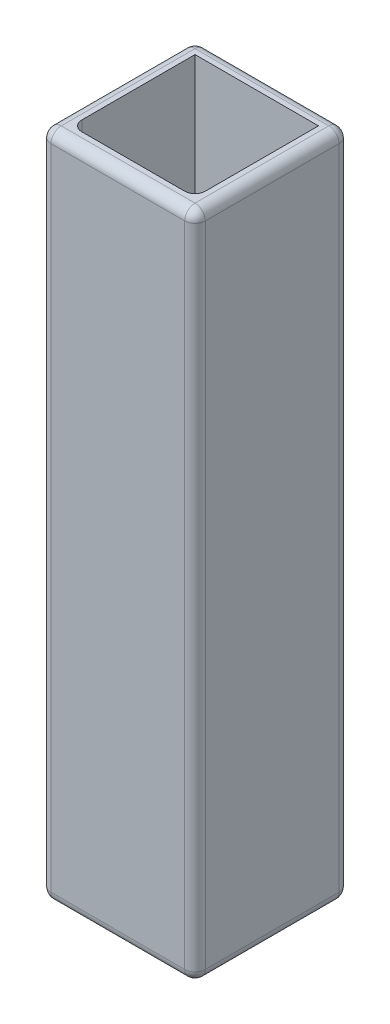
ISO-10303-21;
HEADER;
FILE_DESCRIPTION(('STEP AP214'),'2;1');
FILE_NAME('part.step','',(''),(''),'','','');
FILE_SCHEMA(('AUTOMOTIVE_DESIGN { 1 0 10303 214 1 1 1 1 }'));
ENDSEC;
DATA;
#1=APPLICATION_CONTEXT('core data for automotive mechanical design processes');
#2=APPLICATION_PROTOCOL_DEFINITION('international standard','automotive_design',2000,#1);
#3=PRODUCT_CONTEXT('',#1,'mechanical');
#4=PRODUCT('Part','Part','',(#3));
#5=PRODUCT_RELATED_PRODUCT_CATEGORY('part','',(#4));
#6=PRODUCT_DEFINITION_FORMATION('','',#4);
#7=PRODUCT_DEFINITION_CONTEXT('part definition',#1,'design');
#8=PRODUCT_DEFINITION('design','',#6,#7);
#9=PRODUCT_DEFINITION_SHAPE('','',#8);
#10=(LENGTH_UNIT() NAMED_UNIT(*) SI_UNIT(.MILLI.,.METRE.));
#11=(NAMED_UNIT(*) PLANE_ANGLE_UNIT() SI_UNIT($,.RADIAN.));
#12=(NAMED_UNIT(*) SI_UNIT($,.STERADIAN.) SOLID_ANGLE_UNIT());
#13=UNCERTAINTY_MEASURE_WITH_UNIT(LENGTH_MEASURE(1.E-05),#10,'distance_accuracy_value','');
#14=(GEOMETRIC_REPRESENTATION_CONTEXT(3) GLOBAL_UNCERTAINTY_ASSIGNED_CONTEXT((#13)) GLOBAL_UNIT_ASSIGNED_CONTEXT((#10,
#11,#12)) REPRESENTATION_CONTEXT('',''));
#15=CARTESIAN_POINT('',(0.,0.,0.));
#16=DIRECTION('',(0.,0.,1.));
#17=DIRECTION('',(1.,0.,0.));
#18=AXIS2_PLACEMENT_3D('',#15,#16,#17);
#19=CARTESIAN_POINT('',(0.,130.,0.));
#20=DIRECTION('',(0.,1.,0.));
#21=DIRECTION('',(0.,0.,1.));
#22=AXIS2_PLACEMENT_3D('',#19,#20,#21);
#23=PLANE('',#22);
#24=DIRECTION('',(-1.,0.,0.));
#25=VECTOR('',#24,1.);
#26=CARTESIAN_POINT('',(-15.,130.,-13.));
#27=LINE('',#26,#25);
#28=CARTESIAN_POINT('',(13.,130.,-13.));
#29=VERTEX_POINT('',#28);
#30=CARTESIAN_POINT('',(-13.,130.,-13.));
#31=VERTEX_POINT('',#30);
#32=EDGE_CURVE('E180',#29,#31,#27,.T.);
#33=ORIENTED_EDGE('',*,*,#32,.T.);
#34=DIRECTION('',(0.,0.,1.));
#35=VECTOR('',#34,1.);
#36=CARTESIAN_POINT('',(-13.,130.,15.));
#37=LINE('',#36,#35);
#38=CARTESIAN_POINT('',(-13.,130.,13.));
#39=VERTEX_POINT('',#38);
#40=EDGE_CURVE('E206',#31,#39,#37,.T.);
#41=ORIENTED_EDGE('',*,*,#40,.T.);
#42=DIRECTION('',(1.,0.,0.));
#43=VECTOR('',#42,1.);
#44=CARTESIAN_POINT('',(15.,130.,13.));
#45=LINE('',#44,#43);
#46=CARTESIAN_POINT('',(13.,130.,13.));
#47=VERTEX_POINT('',#46);
#48=EDGE_CURVE('E204',#39,#47,#45,.T.);
#49=ORIENTED_EDGE('',*,*,#48,.T.);
#50=DIRECTION('',(0.,0.,-1.));
#51=VECTOR('',#50,1.);
#52=CARTESIAN_POINT('',(13.,130.,-15.));
#53=LINE('',#52,#51);
#54=EDGE_CURVE('E202',#47,#29,#53,.T.);
#55=ORIENTED_EDGE('',*,*,#54,.T.);
#56=EDGE_LOOP('',(#33,#41,#49,#55));
#57=FACE_BOUND('',#56,.T.);
#58=DIRECTION('',(-1.,0.,0.));
#59=VECTOR('',#58,1.);
#60=CARTESIAN_POINT('',(-12.,130.,-12.));
#61=LINE('',#60,#59);
#62=CARTESIAN_POINT('',(12.,130.,-12.));
#63=VERTEX_POINT('',#62);
#64=CARTESIAN_POINT('',(-12.,130.,-12.));
#65=VERTEX_POINT('',#64);
#66=EDGE_CURVE('E171',#63,#65,#61,.T.);
#67=ORIENTED_EDGE('',*,*,#66,.F.);
#68=DIRECTION('',(0.,0.,-1.));
#69=VECTOR('',#68,1.);
#70=CARTESIAN_POINT('',(12.,130.,-12.));
#71=LINE('',#70,#69);
#72=CARTESIAN_POINT('',(12.,130.,9.99999999999999));
#73=VERTEX_POINT('',#72);
#74=EDGE_CURVE('E161',#73,#63,#71,.T.);
#75=ORIENTED_EDGE('',*,*,#74,.F.);
#76=CARTESIAN_POINT('',(10.,130.,9.99999999999999));
#77=DIRECTION('',(0.,1.,0.));
#78=DIRECTION('',(0.,0.,1.));
#79=AXIS2_PLACEMENT_3D('',#76,#77,#78);
#80=CIRCLE('',#79,2.);
#81=CARTESIAN_POINT('',(10.,130.,12.));
#82=VERTEX_POINT('',#81);
#83=EDGE_CURVE('E11',#73,#82,#80,.F.);
#84=ORIENTED_EDGE('',*,*,#83,.T.);
#85=DIRECTION('',(1.,0.,0.));
#86=VECTOR('',#85,1.);
#87=CARTESIAN_POINT('',(-12.,130.,12.));
#88=LINE('',#87,#86);
#89=CARTESIAN_POINT('',(-9.99999999999999,130.,12.));
#90=VERTEX_POINT('',#89);
#91=EDGE_CURVE('E187',#90,#82,#88,.T.);
#92=ORIENTED_EDGE('',*,*,#91,.F.);
#93=CARTESIAN_POINT('',(-9.99999999999999,130.,9.99999999999999));
#94=DIRECTION('',(0.,1.,0.));
#95=DIRECTION('',(0.,0.,1.));
#96=AXIS2_PLACEMENT_3D('',#93,#94,#95);
#97=CIRCLE('',#96,2.);
#98=CARTESIAN_POINT('',(-12.,130.,9.99999999999999));
#99=VERTEX_POINT('',#98);
#100=EDGE_CURVE('E263',#90,#99,#97,.F.);
#101=ORIENTED_EDGE('',*,*,#100,.T.);
#102=DIRECTION('',(0.,0.,1.));
#103=VECTOR('',#102,1.);
#104=CARTESIAN_POINT('',(-12.,130.,-12.));
#105=LINE('',#104,#103);
#106=EDGE_CURVE('E185',#65,#99,#105,.T.);
#107=ORIENTED_EDGE('',*,*,#106,.F.);
#108=EDGE_LOOP('',(#67,#75,#84,#92,#101,#107));
#109=FACE_BOUND('',#108,.T.);
#110=ADVANCED_FACE('F32',(#57,#109),#23,.T.);
#111=CARTESIAN_POINT('',(0.,0.,0.));
#112=DIRECTION('',(0.,1.,0.));
#113=DIRECTION('',(0.,0.,1.));
#114=AXIS2_PLACEMENT_3D('',#111,#112,#113);
#115=PLANE('',#114);
#116=DIRECTION('',(0.,0.,-1.));
#117=VECTOR('',#116,1.);
#118=CARTESIAN_POINT('',(13.,0.,0.));
#119=LINE('',#118,#117);
#120=CARTESIAN_POINT('',(13.,0.,-13.));
#121=VERTEX_POINT('',#120);
#122=CARTESIAN_POINT('',(13.,0.,13.));
#123=VERTEX_POINT('',#122);
#124=EDGE_CURVE('E49',#121,#123,#119,.F.);
#125=ORIENTED_EDGE('',*,*,#124,.T.);
#126=DIRECTION('',(1.,0.,0.));
#127=VECTOR('',#126,1.);
#128=CARTESIAN_POINT('',(0.,0.,13.));
#129=LINE('',#128,#127);
#130=CARTESIAN_POINT('',(-13.,0.,13.));
#131=VERTEX_POINT('',#130);
#132=EDGE_CURVE('E250',#123,#131,#129,.F.);
#133=ORIENTED_EDGE('',*,*,#132,.T.);
#134=DIRECTION('',(0.,0.,1.));
#135=VECTOR('',#134,1.);
#136=CARTESIAN_POINT('',(-13.,0.,0.));
#137=LINE('',#136,#135);
#138=CARTESIAN_POINT('',(-13.,0.,-13.));
#139=VERTEX_POINT('',#138);
#140=EDGE_CURVE('E247',#131,#139,#137,.F.);
#141=ORIENTED_EDGE('',*,*,#140,.T.);
#142=DIRECTION('',(-1.,0.,0.));
#143=VECTOR('',#142,1.);
#144=CARTESIAN_POINT('',(0.,0.,-13.));
#145=LINE('',#144,#143);
#146=EDGE_CURVE('E245',#139,#121,#145,.F.);
#147=ORIENTED_EDGE('',*,*,#146,.T.);
#148=EDGE_LOOP('',(#125,#133,#141,#147));
#149=FACE_BOUND('',#148,.T.);
#150=DIRECTION('',(1.,0.,0.));
#151=VECTOR('',#150,1.);
#152=CARTESIAN_POINT('',(-12.,0.,12.));
#153=LINE('',#152,#151);
#154=CARTESIAN_POINT('',(-9.99999999999999,0.,12.));
#155=VERTEX_POINT('',#154);
#156=CARTESIAN_POINT('',(10.,0.,12.));
#157=VERTEX_POINT('',#156);
#158=EDGE_CURVE('E172',#155,#157,#153,.T.);
#159=ORIENTED_EDGE('',*,*,#158,.T.);
#160=CARTESIAN_POINT('',(10.,0.,9.99999999999999));
#161=DIRECTION('',(0.,1.,0.));
#162=DIRECTION('',(0.,0.,1.));
#163=AXIS2_PLACEMENT_3D('',#160,#161,#162);
#164=CIRCLE('',#163,2.);
#165=CARTESIAN_POINT('',(12.,0.,9.99999999999999));
#166=VERTEX_POINT('',#165);
#167=EDGE_CURVE('E41',#157,#166,#164,.T.);
#168=ORIENTED_EDGE('',*,*,#167,.T.);
#169=DIRECTION('',(0.,0.,-1.));
#170=VECTOR('',#169,1.);
#171=CARTESIAN_POINT('',(12.,0.,-12.));
#172=LINE('',#171,#170);
#173=CARTESIAN_POINT('',(12.,0.,-12.));
#174=VERTEX_POINT('',#173);
#175=EDGE_CURVE('E192',#166,#174,#172,.T.);
#176=ORIENTED_EDGE('',*,*,#175,.T.);
#177=DIRECTION('',(-1.,0.,0.));
#178=VECTOR('',#177,1.);
#179=CARTESIAN_POINT('',(-12.,0.,-12.));
#180=LINE('',#179,#178);
#181=CARTESIAN_POINT('',(-12.,0.,-12.));
#182=VERTEX_POINT('',#181);
#183=EDGE_CURVE('E179',#174,#182,#180,.T.);
#184=ORIENTED_EDGE('',*,*,#183,.T.);
#185=DIRECTION('',(0.,0.,1.));
#186=VECTOR('',#185,1.);
#187=CARTESIAN_POINT('',(-12.,0.,-12.));
#188=LINE('',#187,#186);
#189=CARTESIAN_POINT('',(-12.,0.,9.99999999999999));
#190=VERTEX_POINT('',#189);
#191=EDGE_CURVE('E195',#182,#190,#188,.T.);
#192=ORIENTED_EDGE('',*,*,#191,.T.);
#193=CARTESIAN_POINT('',(-9.99999999999999,0.,9.99999999999999));
#194=DIRECTION('',(0.,1.,0.));
#195=DIRECTION('',(0.,0.,1.));
#196=AXIS2_PLACEMENT_3D('',#193,#194,#195);
#197=CIRCLE('',#196,2.);
#198=EDGE_CURVE('E261',#190,#155,#197,.T.);
#199=ORIENTED_EDGE('',*,*,#198,.T.);
#200=EDGE_LOOP('',(#159,#168,#176,#184,#192,#199));
#201=FACE_BOUND('',#200,.T.);
#202=ADVANCED_FACE('F375',(#149,#201),#115,.F.);
#203=CARTESIAN_POINT('',(15.,130.,-15.));
#204=DIRECTION('',(-1.,0.,0.));
#205=DIRECTION('',(0.,0.,1.));
#206=AXIS2_PLACEMENT_3D('',#203,#204,#205);
#207=PLANE('',#206);
#208=DIRECTION('',(0.,0.,-1.));
#209=VECTOR('',#208,1.);
#210=CARTESIAN_POINT('',(15.,2.,-15.));
#211=LINE('',#210,#209);
#212=CARTESIAN_POINT('',(15.,2.,13.));
#213=VERTEX_POINT('',#212);
#214=CARTESIAN_POINT('',(15.,2.,-13.));
#215=VERTEX_POINT('',#214);
#216=EDGE_CURVE('E229',#213,#215,#211,.T.);
#217=ORIENTED_EDGE('',*,*,#216,.T.);
#218=DIRECTION('',(0.,-1.,0.));
#219=VECTOR('',#218,1.);
#220=CARTESIAN_POINT('',(15.,130.,-13.));
#221=LINE('',#220,#219);
#222=CARTESIAN_POINT('',(15.,128.,-13.));
#223=VERTEX_POINT('',#222);
#224=EDGE_CURVE('E234',#215,#223,#221,.F.);
#225=ORIENTED_EDGE('',*,*,#224,.T.);
#226=DIRECTION('',(0.,0.,-1.));
#227=VECTOR('',#226,1.);
#228=CARTESIAN_POINT('',(15.,128.,15.));
#229=LINE('',#228,#227);
#230=CARTESIAN_POINT('',(15.,128.,13.));
#231=VERTEX_POINT('',#230);
#232=EDGE_CURVE('E231',#223,#231,#229,.F.);
#233=ORIENTED_EDGE('',*,*,#232,.T.);
#234=DIRECTION('',(0.,-1.,0.));
#235=VECTOR('',#234,1.);
#236=CARTESIAN_POINT('',(15.,130.,13.));
#237=LINE('',#236,#235);
#238=EDGE_CURVE('E227',#231,#213,#237,.T.);
#239=ORIENTED_EDGE('',*,*,#238,.T.);
#240=EDGE_LOOP('',(#217,#225,#233,#239));
#241=FACE_BOUND('',#240,.T.);
#242=ADVANCED_FACE('F354',(#241),#207,.F.);
#243=CARTESIAN_POINT('',(-15.,130.,-15.));
#244=DIRECTION('',(0.,0.,1.));
#245=DIRECTION('',(1.,0.,0.));
#246=AXIS2_PLACEMENT_3D('',#243,#244,#245);
#247=PLANE('',#246);
#248=DIRECTION('',(-1.,0.,0.));
#249=VECTOR('',#248,1.);
#250=CARTESIAN_POINT('',(-15.,2.,-15.));
#251=LINE('',#250,#249);
#252=CARTESIAN_POINT('',(13.,2.,-15.));
#253=VERTEX_POINT('',#252);
#254=CARTESIAN_POINT('',(-13.,2.,-15.));
#255=VERTEX_POINT('',#254);
#256=EDGE_CURVE('E238',#253,#255,#251,.T.);
#257=ORIENTED_EDGE('',*,*,#256,.T.);
#258=DIRECTION('',(0.,-1.,0.));
#259=VECTOR('',#258,1.);
#260=CARTESIAN_POINT('',(-13.,130.,-15.));
#261=LINE('',#260,#259);
#262=CARTESIAN_POINT('',(-13.,128.,-15.));
#263=VERTEX_POINT('',#262);
#264=EDGE_CURVE('E243',#255,#263,#261,.F.);
#265=ORIENTED_EDGE('',*,*,#264,.T.);
#266=DIRECTION('',(-1.,0.,0.));
#267=VECTOR('',#266,1.);
#268=CARTESIAN_POINT('',(15.,128.,-15.));
#269=LINE('',#268,#267);
#270=CARTESIAN_POINT('',(13.,128.,-15.));
#271=VERTEX_POINT('',#270);
#272=EDGE_CURVE('E240',#263,#271,#269,.F.);
#273=ORIENTED_EDGE('',*,*,#272,.T.);
#274=DIRECTION('',(0.,-1.,0.));
#275=VECTOR('',#274,1.);
#276=CARTESIAN_POINT('',(13.,130.,-15.));
#277=LINE('',#276,#275);
#278=EDGE_CURVE('E236',#271,#253,#277,.T.);
#279=ORIENTED_EDGE('',*,*,#278,.T.);
#280=EDGE_LOOP('',(#257,#265,#273,#279));
#281=FACE_BOUND('',#280,.T.);
#282=ADVANCED_FACE('F345',(#281),#247,.F.);
#283=CARTESIAN_POINT('',(-15.,130.,-15.));
#284=DIRECTION('',(1.,0.,0.));
#285=DIRECTION('',(0.,0.,-1.));
#286=AXIS2_PLACEMENT_3D('',#283,#284,#285);
#287=PLANE('',#286);
#288=DIRECTION('',(0.,0.,1.));
#289=VECTOR('',#288,1.);
#290=CARTESIAN_POINT('',(-15.,128.,-15.));
#291=LINE('',#290,#289);
#292=CARTESIAN_POINT('',(-15.,128.,13.));
#293=VERTEX_POINT('',#292);
#294=CARTESIAN_POINT('',(-15.,128.,-13.));
#295=VERTEX_POINT('',#294);
#296=EDGE_CURVE('E213',#293,#295,#291,.F.);
#297=ORIENTED_EDGE('',*,*,#296,.T.);
#298=DIRECTION('',(0.,-1.,0.));
#299=VECTOR('',#298,1.);
#300=CARTESIAN_POINT('',(-15.,130.,-13.));
#301=LINE('',#300,#299);
#302=CARTESIAN_POINT('',(-15.,2.,-13.));
#303=VERTEX_POINT('',#302);
#304=EDGE_CURVE('E216',#295,#303,#301,.T.);
#305=ORIENTED_EDGE('',*,*,#304,.T.);
#306=DIRECTION('',(0.,0.,1.));
#307=VECTOR('',#306,1.);
#308=CARTESIAN_POINT('',(-15.,2.,-15.));
#309=LINE('',#308,#307);
#310=CARTESIAN_POINT('',(-15.,2.,13.));
#311=VERTEX_POINT('',#310);
#312=EDGE_CURVE('E211',#303,#311,#309,.T.);
#313=ORIENTED_EDGE('',*,*,#312,.T.);
#314=DIRECTION('',(0.,-1.,0.));
#315=VECTOR('',#314,1.);
#316=CARTESIAN_POINT('',(-15.,130.,13.));
#317=LINE('',#316,#315);
#318=EDGE_CURVE('E209',#311,#293,#317,.F.);
#319=ORIENTED_EDGE('',*,*,#318,.T.);
#320=EDGE_LOOP('',(#297,#305,#313,#319));
#321=FACE_BOUND('',#320,.T.);
#322=ADVANCED_FACE('F420',(#321),#287,.F.);
#323=CARTESIAN_POINT('',(-15.,130.,15.));
#324=DIRECTION('',(0.,0.,-1.));
#325=DIRECTION('',(-1.,0.,0.));
#326=AXIS2_PLACEMENT_3D('',#323,#324,#325);
#327=PLANE('',#326);
#328=DIRECTION('',(1.,0.,0.));
#329=VECTOR('',#328,1.);
#330=CARTESIAN_POINT('',(-15.,128.,15.));
#331=LINE('',#330,#329);
#332=CARTESIAN_POINT('',(13.,128.,15.));
#333=VERTEX_POINT('',#332);
#334=CARTESIAN_POINT('',(-13.,128.,15.));
#335=VERTEX_POINT('',#334);
#336=EDGE_CURVE('E222',#333,#335,#331,.F.);
#337=ORIENTED_EDGE('',*,*,#336,.T.);
#338=DIRECTION('',(0.,-1.,0.));
#339=VECTOR('',#338,1.);
#340=CARTESIAN_POINT('',(-13.,130.,15.));
#341=LINE('',#340,#339);
#342=CARTESIAN_POINT('',(-13.,2.,15.));
#343=VERTEX_POINT('',#342);
#344=EDGE_CURVE('E225',#335,#343,#341,.T.);
#345=ORIENTED_EDGE('',*,*,#344,.T.);
#346=DIRECTION('',(1.,0.,0.));
#347=VECTOR('',#346,1.);
#348=CARTESIAN_POINT('',(-15.,2.,15.));
#349=LINE('',#348,#347);
#350=CARTESIAN_POINT('',(13.,2.,15.));
#351=VERTEX_POINT('',#350);
#352=EDGE_CURVE('E220',#343,#351,#349,.T.);
#353=ORIENTED_EDGE('',*,*,#352,.T.);
#354=DIRECTION('',(0.,-1.,0.));
#355=VECTOR('',#354,1.);
#356=CARTESIAN_POINT('',(13.,130.,15.));
#357=LINE('',#356,#355);
#358=EDGE_CURVE('E218',#351,#333,#357,.F.);
#359=ORIENTED_EDGE('',*,*,#358,.T.);
#360=EDGE_LOOP('',(#337,#345,#353,#359));
#361=FACE_BOUND('',#360,.T.);
#362=ADVANCED_FACE('F417',(#361),#327,.F.);
#363=CARTESIAN_POINT('',(12.,130.,-12.));
#364=DIRECTION('',(-1.,0.,0.));
#365=DIRECTION('',(0.,0.,1.));
#366=AXIS2_PLACEMENT_3D('',#363,#364,#365);
#367=PLANE('',#366);
#368=ORIENTED_EDGE('',*,*,#175,.F.);
#369=DIRECTION('',(0.,-1.,0.));
#370=VECTOR('',#369,1.);
#371=CARTESIAN_POINT('',(12.,130.,9.99999999999999));
#372=LINE('',#371,#370);
#373=EDGE_CURVE('E167',#166,#73,#372,.F.);
#374=ORIENTED_EDGE('',*,*,#373,.T.);
#375=ORIENTED_EDGE('',*,*,#74,.T.);
#376=DIRECTION('',(0.,-1.,0.));
#377=VECTOR('',#376,1.);
#378=CARTESIAN_POINT('',(12.,130.,-12.));
#379=LINE('',#378,#377);
#380=EDGE_CURVE('E165',#63,#174,#379,.T.);
#381=ORIENTED_EDGE('',*,*,#380,.T.);
#382=EDGE_LOOP('',(#368,#374,#375,#381));
#383=FACE_BOUND('',#382,.T.);
#384=ADVANCED_FACE('F164',(#383),#367,.T.);
#385=CARTESIAN_POINT('',(-12.,130.,-12.));
#386=DIRECTION('',(0.,0.,1.));
#387=DIRECTION('',(1.,0.,0.));
#388=AXIS2_PLACEMENT_3D('',#385,#386,#387);
#389=PLANE('',#388);
#390=ORIENTED_EDGE('',*,*,#183,.F.);
#391=ORIENTED_EDGE('',*,*,#380,.F.);
#392=ORIENTED_EDGE('',*,*,#66,.T.);
#393=DIRECTION('',(0.,-1.,0.));
#394=VECTOR('',#393,1.);
#395=CARTESIAN_POINT('',(-12.,130.,-12.));
#396=LINE('',#395,#394);
#397=EDGE_CURVE('E181',#65,#182,#396,.T.);
#398=ORIENTED_EDGE('',*,*,#397,.T.);
#399=EDGE_LOOP('',(#390,#391,#392,#398));
#400=FACE_BOUND('',#399,.T.);
#401=ADVANCED_FACE('F176',(#400),#389,.T.);
#402=CARTESIAN_POINT('',(-12.,130.,-12.));
#403=DIRECTION('',(1.,0.,0.));
#404=DIRECTION('',(0.,0.,-1.));
#405=AXIS2_PLACEMENT_3D('',#402,#403,#404);
#406=PLANE('',#405);
#407=ORIENTED_EDGE('',*,*,#106,.T.);
#408=DIRECTION('',(0.,-1.,0.));
#409=VECTOR('',#408,1.);
#410=CARTESIAN_POINT('',(-12.,0.,9.99999999999999));
#411=LINE('',#410,#409);
#412=EDGE_CURVE('E252',#99,#190,#411,.T.);
#413=ORIENTED_EDGE('',*,*,#412,.T.);
#414=ORIENTED_EDGE('',*,*,#191,.F.);
#415=ORIENTED_EDGE('',*,*,#397,.F.);
#416=EDGE_LOOP('',(#407,#413,#414,#415));
#417=FACE_BOUND('',#416,.T.);
#418=ADVANCED_FACE('F602',(#417),#406,.T.);
#419=CARTESIAN_POINT('',(-12.,130.,12.));
#420=DIRECTION('',(0.,0.,-1.));
#421=DIRECTION('',(-1.,0.,0.));
#422=AXIS2_PLACEMENT_3D('',#419,#420,#421);
#423=PLANE('',#422);
#424=ORIENTED_EDGE('',*,*,#158,.F.);
#425=DIRECTION('',(0.,-1.,0.));
#426=VECTOR('',#425,1.);
#427=CARTESIAN_POINT('',(-9.99999999999999,130.,12.));
#428=LINE('',#427,#426);
#429=EDGE_CURVE('E258',#155,#90,#428,.F.);
#430=ORIENTED_EDGE('',*,*,#429,.T.);
#431=ORIENTED_EDGE('',*,*,#91,.T.);
#432=DIRECTION('',(0.,-1.,0.));
#433=VECTOR('',#432,1.);
#434=CARTESIAN_POINT('',(10.,0.,12.));
#435=LINE('',#434,#433);
#436=EDGE_CURVE('E255',#82,#157,#435,.T.);
#437=ORIENTED_EDGE('',*,*,#436,.T.);
#438=EDGE_LOOP('',(#424,#430,#431,#437));
#439=FACE_BOUND('',#438,.T.);
#440=ADVANCED_FACE('F594',(#439),#423,.T.);
#441=CARTESIAN_POINT('',(13.,2.,-15.));
#442=DIRECTION('',(0.,0.,-1.));
#443=DIRECTION('',(-1.,0.,0.));
#444=AXIS2_PLACEMENT_3D('',#441,#442,#443);
#445=CYLINDRICAL_SURFACE('',#444,2.);
#446=CARTESIAN_POINT('',(13.,2.,-13.));
#447=DIRECTION('',(0.,0.,-1.));
#448=DIRECTION('',(-1.,0.,0.));
#449=AXIS2_PLACEMENT_3D('',#446,#447,#448);
#450=CIRCLE('',#449,2.);
#451=EDGE_CURVE('E36',#215,#121,#450,.T.);
#452=ORIENTED_EDGE('',*,*,#451,.F.);
#453=ORIENTED_EDGE('',*,*,#216,.F.);
#454=CARTESIAN_POINT('',(13.,2.,13.));
#455=DIRECTION('',(0.,0.,1.));
#456=DIRECTION('',(1.,0.,0.));
#457=AXIS2_PLACEMENT_3D('',#454,#455,#456);
#458=CIRCLE('',#457,2.);
#459=EDGE_CURVE('E323',#123,#213,#458,.T.);
#460=ORIENTED_EDGE('',*,*,#459,.F.);
#461=ORIENTED_EDGE('',*,*,#124,.F.);
#462=EDGE_LOOP('',(#452,#453,#460,#461));
#463=FACE_BOUND('',#462,.T.);
#464=ADVANCED_FACE('F368',(#463),#445,.T.);
#465=CARTESIAN_POINT('',(13.,2.,-13.));
#466=DIRECTION('',(0.,0.,1.));
#467=DIRECTION('',(1.,0.,0.));
#468=AXIS2_PLACEMENT_3D('',#465,#466,#467);
#469=SPHERICAL_SURFACE('',#468,2.);
#470=CARTESIAN_POINT('',(13.,2.,-13.));
#471=DIRECTION('',(0.,-1.,0.));
#472=DIRECTION('',(0.,0.,-1.));
#473=AXIS2_PLACEMENT_3D('',#470,#471,#472);
#474=CIRCLE('',#473,2.);
#475=EDGE_CURVE('E318',#215,#253,#474,.F.);
#476=ORIENTED_EDGE('',*,*,#475,.F.);
#477=ORIENTED_EDGE('',*,*,#451,.T.);
#478=CARTESIAN_POINT('',(13.,2.,-13.));
#479=DIRECTION('',(1.,0.,0.));
#480=DIRECTION('',(0.,0.,-1.));
#481=AXIS2_PLACEMENT_3D('',#478,#479,#480);
#482=CIRCLE('',#481,2.);
#483=EDGE_CURVE('E321',#253,#121,#482,.F.);
#484=ORIENTED_EDGE('',*,*,#483,.F.);
#485=EDGE_LOOP('',(#476,#477,#484));
#486=FACE_BOUND('',#485,.T.);
#487=ADVANCED_FACE('F333',(#486),#469,.T.);
#488=CARTESIAN_POINT('',(13.,2.,13.));
#489=DIRECTION('',(0.,0.,1.));
#490=DIRECTION('',(1.,0.,0.));
#491=AXIS2_PLACEMENT_3D('',#488,#489,#490);
#492=SPHERICAL_SURFACE('',#491,2.);
#493=CARTESIAN_POINT('',(13.,2.,13.));
#494=DIRECTION('',(1.,0.,0.));
#495=DIRECTION('',(0.,0.,-1.));
#496=AXIS2_PLACEMENT_3D('',#493,#494,#495);
#497=CIRCLE('',#496,2.);
#498=EDGE_CURVE('E312',#123,#351,#497,.F.);
#499=ORIENTED_EDGE('',*,*,#498,.F.);
#500=ORIENTED_EDGE('',*,*,#459,.T.);
#501=CARTESIAN_POINT('',(13.,2.,13.));
#502=DIRECTION('',(0.,-1.,0.));
#503=DIRECTION('',(0.,0.,-1.));
#504=AXIS2_PLACEMENT_3D('',#501,#502,#503);
#505=CIRCLE('',#504,2.);
#506=EDGE_CURVE('E315',#351,#213,#505,.F.);
#507=ORIENTED_EDGE('',*,*,#506,.F.);
#508=EDGE_LOOP('',(#499,#500,#507));
#509=FACE_BOUND('',#508,.T.);
#510=ADVANCED_FACE('F370',(#509),#492,.T.);
#511=CARTESIAN_POINT('',(-15.,2.,-13.));
#512=DIRECTION('',(-1.,0.,0.));
#513=DIRECTION('',(0.,0.,1.));
#514=AXIS2_PLACEMENT_3D('',#511,#512,#513);
#515=CYLINDRICAL_SURFACE('',#514,2.);
#516=ORIENTED_EDGE('',*,*,#483,.T.);
#517=ORIENTED_EDGE('',*,*,#146,.F.);
#518=CARTESIAN_POINT('',(-13.,2.,-13.));
#519=DIRECTION('',(-1.,0.,0.));
#520=DIRECTION('',(0.,0.,1.));
#521=AXIS2_PLACEMENT_3D('',#518,#519,#520);
#522=CIRCLE('',#521,2.);
#523=EDGE_CURVE('E306',#255,#139,#522,.T.);
#524=ORIENTED_EDGE('',*,*,#523,.F.);
#525=ORIENTED_EDGE('',*,*,#256,.F.);
#526=EDGE_LOOP('',(#516,#517,#524,#525));
#527=FACE_BOUND('',#526,.T.);
#528=ADVANCED_FACE('F340',(#527),#515,.T.);
#529=CARTESIAN_POINT('',(13.,130.,-13.));
#530=DIRECTION('',(0.,-1.,0.));
#531=DIRECTION('',(0.,0.,-1.));
#532=AXIS2_PLACEMENT_3D('',#529,#530,#531);
#533=CYLINDRICAL_SURFACE('',#532,2.);
#534=ORIENTED_EDGE('',*,*,#475,.T.);
#535=ORIENTED_EDGE('',*,*,#278,.F.);
#536=CARTESIAN_POINT('',(13.,128.,-13.));
#537=DIRECTION('',(0.,1.,0.));
#538=DIRECTION('',(0.,0.,1.));
#539=AXIS2_PLACEMENT_3D('',#536,#537,#538);
#540=CIRCLE('',#539,2.);
#541=EDGE_CURVE('E303',#223,#271,#540,.T.);
#542=ORIENTED_EDGE('',*,*,#541,.F.);
#543=ORIENTED_EDGE('',*,*,#224,.F.);
#544=EDGE_LOOP('',(#534,#535,#542,#543));
#545=FACE_BOUND('',#544,.T.);
#546=ADVANCED_FACE('F351',(#545),#533,.T.);
#547=CARTESIAN_POINT('',(13.,128.,0.));
#548=DIRECTION('',(0.,0.,1.));
#549=DIRECTION('',(1.,0.,0.));
#550=AXIS2_PLACEMENT_3D('',#547,#548,#549);
#551=CYLINDRICAL_SURFACE('',#550,2.);
#552=CARTESIAN_POINT('',(13.,128.,13.));
#553=DIRECTION('',(0.,0.,1.));
#554=DIRECTION('',(0.,-1.,0.));
#555=AXIS2_PLACEMENT_3D('',#552,#553,#554);
#556=CIRCLE('',#555,2.);
#557=EDGE_CURVE('E297',#231,#47,#556,.T.);
#558=ORIENTED_EDGE('',*,*,#557,.F.);
#559=ORIENTED_EDGE('',*,*,#232,.F.);
#560=CARTESIAN_POINT('',(13.,128.,-13.));
#561=DIRECTION('',(0.,0.,-1.));
#562=DIRECTION('',(-1.,0.,0.));
#563=AXIS2_PLACEMENT_3D('',#560,#561,#562);
#564=CIRCLE('',#563,2.);
#565=EDGE_CURVE('E300',#29,#223,#564,.T.);
#566=ORIENTED_EDGE('',*,*,#565,.F.);
#567=ORIENTED_EDGE('',*,*,#54,.F.);
#568=EDGE_LOOP('',(#558,#559,#566,#567));
#569=FACE_BOUND('',#568,.T.);
#570=ADVANCED_FACE('F358',(#569),#551,.T.);
#571=CARTESIAN_POINT('',(13.,130.,13.));
#572=DIRECTION('',(0.,-1.,0.));
#573=DIRECTION('',(0.,0.,-1.));
#574=AXIS2_PLACEMENT_3D('',#571,#572,#573);
#575=CYLINDRICAL_SURFACE('',#574,2.);
#576=ORIENTED_EDGE('',*,*,#506,.T.);
#577=ORIENTED_EDGE('',*,*,#238,.F.);
#578=CARTESIAN_POINT('',(13.,128.,13.));
#579=DIRECTION('',(0.,1.,0.));
#580=DIRECTION('',(0.,0.,1.));
#581=AXIS2_PLACEMENT_3D('',#578,#579,#580);
#582=CIRCLE('',#581,2.);
#583=EDGE_CURVE('E295',#333,#231,#582,.T.);
#584=ORIENTED_EDGE('',*,*,#583,.F.);
#585=ORIENTED_EDGE('',*,*,#358,.F.);
#586=EDGE_LOOP('',(#576,#577,#584,#585));
#587=FACE_BOUND('',#586,.T.);
#588=ADVANCED_FACE('F366',(#587),#575,.T.);
#589=CARTESIAN_POINT('',(-15.,2.,13.));
#590=DIRECTION('',(1.,0.,0.));
#591=DIRECTION('',(0.,0.,-1.));
#592=AXIS2_PLACEMENT_3D('',#589,#590,#591);
#593=CYLINDRICAL_SURFACE('',#592,2.);
#594=ORIENTED_EDGE('',*,*,#498,.T.);
#595=ORIENTED_EDGE('',*,*,#352,.F.);
#596=CARTESIAN_POINT('',(-13.,2.,13.));
#597=DIRECTION('',(-1.,0.,0.));
#598=DIRECTION('',(0.,0.,1.));
#599=AXIS2_PLACEMENT_3D('',#596,#597,#598);
#600=CIRCLE('',#599,2.);
#601=EDGE_CURVE('E293',#131,#343,#600,.T.);
#602=ORIENTED_EDGE('',*,*,#601,.F.);
#603=ORIENTED_EDGE('',*,*,#132,.F.);
#604=EDGE_LOOP('',(#594,#595,#602,#603));
#605=FACE_BOUND('',#604,.T.);
#606=ADVANCED_FACE('F373',(#605),#593,.T.);
#607=CARTESIAN_POINT('',(-13.,2.,-15.));
#608=DIRECTION('',(0.,0.,1.));
#609=DIRECTION('',(1.,0.,0.));
#610=AXIS2_PLACEMENT_3D('',#607,#608,#609);
#611=CYLINDRICAL_SURFACE('',#610,2.);
#612=CARTESIAN_POINT('',(-13.,2.,-13.));
#613=DIRECTION('',(0.,0.,-1.));
#614=DIRECTION('',(-1.,0.,0.));
#615=AXIS2_PLACEMENT_3D('',#612,#613,#614);
#616=CIRCLE('',#615,2.);
#617=EDGE_CURVE('E309',#139,#303,#616,.T.);
#618=ORIENTED_EDGE('',*,*,#617,.F.);
#619=ORIENTED_EDGE('',*,*,#140,.F.);
#620=CARTESIAN_POINT('',(-13.,2.,13.));
#621=DIRECTION('',(0.,0.,1.));
#622=DIRECTION('',(1.,0.,0.));
#623=AXIS2_PLACEMENT_3D('',#620,#621,#622);
#624=CIRCLE('',#623,2.);
#625=EDGE_CURVE('E57',#311,#131,#624,.T.);
#626=ORIENTED_EDGE('',*,*,#625,.F.);
#627=ORIENTED_EDGE('',*,*,#312,.F.);
#628=EDGE_LOOP('',(#618,#619,#626,#627));
#629=FACE_BOUND('',#628,.T.);
#630=ADVANCED_FACE('F378',(#629),#611,.T.);
#631=CARTESIAN_POINT('',(-13.,2.,-13.));
#632=DIRECTION('',(0.,0.,1.));
#633=DIRECTION('',(1.,0.,0.));
#634=AXIS2_PLACEMENT_3D('',#631,#632,#633);
#635=SPHERICAL_SURFACE('',#634,2.);
#636=ORIENTED_EDGE('',*,*,#523,.T.);
#637=ORIENTED_EDGE('',*,*,#617,.T.);
#638=CARTESIAN_POINT('',(-13.,2.,-13.));
#639=DIRECTION('',(0.,-1.,0.));
#640=DIRECTION('',(0.,0.,-1.));
#641=AXIS2_PLACEMENT_3D('',#638,#639,#640);
#642=CIRCLE('',#641,2.);
#643=EDGE_CURVE('E289',#255,#303,#642,.F.);
#644=ORIENTED_EDGE('',*,*,#643,.F.);
#645=EDGE_LOOP('',(#636,#637,#644));
#646=FACE_BOUND('',#645,.T.);
#647=ADVANCED_FACE('F381',(#646),#635,.T.);
#648=CARTESIAN_POINT('',(13.,128.,-13.));
#649=DIRECTION('',(0.,0.,1.));
#650=DIRECTION('',(1.,0.,0.));
#651=AXIS2_PLACEMENT_3D('',#648,#649,#650);
#652=SPHERICAL_SURFACE('',#651,2.);
#653=ORIENTED_EDGE('',*,*,#565,.T.);
#654=ORIENTED_EDGE('',*,*,#541,.T.);
#655=CARTESIAN_POINT('',(13.,128.,-13.));
#656=DIRECTION('',(1.,0.,0.));
#657=DIRECTION('',(0.,0.,-1.));
#658=AXIS2_PLACEMENT_3D('',#655,#656,#657);
#659=CIRCLE('',#658,2.);
#660=EDGE_CURVE('E287',#29,#271,#659,.F.);
#661=ORIENTED_EDGE('',*,*,#660,.F.);
#662=EDGE_LOOP('',(#653,#654,#661));
#663=FACE_BOUND('',#662,.T.);
#664=ADVANCED_FACE('F395',(#663),#652,.T.);
#665=CARTESIAN_POINT('',(13.,128.,13.));
#666=DIRECTION('',(0.,0.,1.));
#667=DIRECTION('',(1.,0.,0.));
#668=AXIS2_PLACEMENT_3D('',#665,#666,#667);
#669=SPHERICAL_SURFACE('',#668,2.);
#670=ORIENTED_EDGE('',*,*,#583,.T.);
#671=ORIENTED_EDGE('',*,*,#557,.T.);
#672=CARTESIAN_POINT('',(13.,128.,13.));
#673=DIRECTION('',(1.,0.,0.));
#674=DIRECTION('',(0.,0.,-1.));
#675=AXIS2_PLACEMENT_3D('',#672,#673,#674);
#676=CIRCLE('',#675,2.);
#677=EDGE_CURVE('E284',#333,#47,#676,.F.);
#678=ORIENTED_EDGE('',*,*,#677,.F.);
#679=EDGE_LOOP('',(#670,#671,#678));
#680=FACE_BOUND('',#679,.T.);
#681=ADVANCED_FACE('F397',(#680),#669,.T.);
#682=CARTESIAN_POINT('',(-13.,2.,13.));
#683=DIRECTION('',(0.,0.,1.));
#684=DIRECTION('',(1.,0.,0.));
#685=AXIS2_PLACEMENT_3D('',#682,#683,#684);
#686=SPHERICAL_SURFACE('',#685,2.);
#687=ORIENTED_EDGE('',*,*,#625,.T.);
#688=ORIENTED_EDGE('',*,*,#601,.T.);
#689=CARTESIAN_POINT('',(-13.,2.,13.));
#690=DIRECTION('',(0.,-1.,0.));
#691=DIRECTION('',(0.,0.,-1.));
#692=AXIS2_PLACEMENT_3D('',#689,#690,#691);
#693=CIRCLE('',#692,2.);
#694=EDGE_CURVE('E281',#311,#343,#693,.F.);
#695=ORIENTED_EDGE('',*,*,#694,.F.);
#696=EDGE_LOOP('',(#687,#688,#695));
#697=FACE_BOUND('',#696,.T.);
#698=ADVANCED_FACE('F403',(#697),#686,.T.);
#699=CARTESIAN_POINT('',(-13.,130.,-13.));
#700=DIRECTION('',(0.,-1.,0.));
#701=DIRECTION('',(0.,0.,-1.));
#702=AXIS2_PLACEMENT_3D('',#699,#700,#701);
#703=CYLINDRICAL_SURFACE('',#702,2.);
#704=ORIENTED_EDGE('',*,*,#643,.T.);
#705=ORIENTED_EDGE('',*,*,#304,.F.);
#706=CARTESIAN_POINT('',(-13.,128.,-13.));
#707=DIRECTION('',(0.,1.,0.));
#708=DIRECTION('',(0.,0.,1.));
#709=AXIS2_PLACEMENT_3D('',#706,#707,#708);
#710=CIRCLE('',#709,2.);
#711=EDGE_CURVE('E278',#263,#295,#710,.T.);
#712=ORIENTED_EDGE('',*,*,#711,.F.);
#713=ORIENTED_EDGE('',*,*,#264,.F.);
#714=EDGE_LOOP('',(#704,#705,#712,#713));
#715=FACE_BOUND('',#714,.T.);
#716=ADVANCED_FACE('F385',(#715),#703,.T.);
#717=CARTESIAN_POINT('',(0.,128.,-13.));
#718=DIRECTION('',(1.,0.,0.));
#719=DIRECTION('',(0.,0.,-1.));
#720=AXIS2_PLACEMENT_3D('',#717,#718,#719);
#721=CYLINDRICAL_SURFACE('',#720,2.);
#722=ORIENTED_EDGE('',*,*,#660,.T.);
#723=ORIENTED_EDGE('',*,*,#272,.F.);
#724=CARTESIAN_POINT('',(-13.,128.,-13.));
#725=DIRECTION('',(-1.,0.,0.));
#726=DIRECTION('',(0.,0.,1.));
#727=AXIS2_PLACEMENT_3D('',#724,#725,#726);
#728=CIRCLE('',#727,2.);
#729=EDGE_CURVE('E275',#31,#263,#728,.T.);
#730=ORIENTED_EDGE('',*,*,#729,.F.);
#731=ORIENTED_EDGE('',*,*,#32,.F.);
#732=EDGE_LOOP('',(#722,#723,#730,#731));
#733=FACE_BOUND('',#732,.T.);
#734=ADVANCED_FACE('F393',(#733),#721,.T.);
#735=CARTESIAN_POINT('',(0.,128.,13.));
#736=DIRECTION('',(-1.,0.,0.));
#737=DIRECTION('',(0.,0.,1.));
#738=AXIS2_PLACEMENT_3D('',#735,#736,#737);
#739=CYLINDRICAL_SURFACE('',#738,2.);
#740=ORIENTED_EDGE('',*,*,#677,.T.);
#741=ORIENTED_EDGE('',*,*,#48,.F.);
#742=CARTESIAN_POINT('',(-13.,128.,13.));
#743=DIRECTION('',(-1.,0.,0.));
#744=DIRECTION('',(0.,0.,1.));
#745=AXIS2_PLACEMENT_3D('',#742,#743,#744);
#746=CIRCLE('',#745,2.);
#747=EDGE_CURVE('E272',#335,#39,#746,.T.);
#748=ORIENTED_EDGE('',*,*,#747,.F.);
#749=ORIENTED_EDGE('',*,*,#336,.F.);
#750=EDGE_LOOP('',(#740,#741,#748,#749));
#751=FACE_BOUND('',#750,.T.);
#752=ADVANCED_FACE('F443',(#751),#739,.T.);
#753=CARTESIAN_POINT('',(-13.,130.,13.));
#754=DIRECTION('',(0.,-1.,0.));
#755=DIRECTION('',(0.,0.,-1.));
#756=AXIS2_PLACEMENT_3D('',#753,#754,#755);
#757=CYLINDRICAL_SURFACE('',#756,2.);
#758=ORIENTED_EDGE('',*,*,#694,.T.);
#759=ORIENTED_EDGE('',*,*,#344,.F.);
#760=CARTESIAN_POINT('',(-13.,128.,13.));
#761=DIRECTION('',(0.,1.,0.));
#762=DIRECTION('',(0.,0.,1.));
#763=AXIS2_PLACEMENT_3D('',#760,#761,#762);
#764=CIRCLE('',#763,2.);
#765=EDGE_CURVE('E270',#293,#335,#764,.T.);
#766=ORIENTED_EDGE('',*,*,#765,.F.);
#767=ORIENTED_EDGE('',*,*,#318,.F.);
#768=EDGE_LOOP('',(#758,#759,#766,#767));
#769=FACE_BOUND('',#768,.T.);
#770=ADVANCED_FACE('F440',(#769),#757,.T.);
#771=CARTESIAN_POINT('',(-13.,128.,-13.));
#772=DIRECTION('',(0.,0.,1.));
#773=DIRECTION('',(1.,0.,0.));
#774=AXIS2_PLACEMENT_3D('',#771,#772,#773);
#775=SPHERICAL_SURFACE('',#774,2.);
#776=ORIENTED_EDGE('',*,*,#729,.T.);
#777=ORIENTED_EDGE('',*,*,#711,.T.);
#778=CARTESIAN_POINT('',(-13.,128.,-13.));
#779=DIRECTION('',(0.,0.,-1.));
#780=DIRECTION('',(-1.,0.,0.));
#781=AXIS2_PLACEMENT_3D('',#778,#779,#780);
#782=CIRCLE('',#781,2.);
#783=EDGE_CURVE('E268',#31,#295,#782,.F.);
#784=ORIENTED_EDGE('',*,*,#783,.F.);
#785=EDGE_LOOP('',(#776,#777,#784));
#786=FACE_BOUND('',#785,.T.);
#787=ADVANCED_FACE('F389',(#786),#775,.T.);
#788=CARTESIAN_POINT('',(-13.,128.,13.));
#789=DIRECTION('',(0.,0.,1.));
#790=DIRECTION('',(1.,0.,0.));
#791=AXIS2_PLACEMENT_3D('',#788,#789,#790);
#792=SPHERICAL_SURFACE('',#791,2.);
#793=ORIENTED_EDGE('',*,*,#765,.T.);
#794=ORIENTED_EDGE('',*,*,#747,.T.);
#795=CARTESIAN_POINT('',(-13.,128.,13.));
#796=DIRECTION('',(0.,0.,1.));
#797=DIRECTION('',(1.,0.,0.));
#798=AXIS2_PLACEMENT_3D('',#795,#796,#797);
#799=CIRCLE('',#798,2.);
#800=EDGE_CURVE('E266',#293,#39,#799,.F.);
#801=ORIENTED_EDGE('',*,*,#800,.F.);
#802=EDGE_LOOP('',(#793,#794,#801));
#803=FACE_BOUND('',#802,.T.);
#804=ADVANCED_FACE('F433',(#803),#792,.T.);
#805=CARTESIAN_POINT('',(-13.,128.,0.));
#806=DIRECTION('',(0.,0.,-1.));
#807=DIRECTION('',(-1.,0.,0.));
#808=AXIS2_PLACEMENT_3D('',#805,#806,#807);
#809=CYLINDRICAL_SURFACE('',#808,2.);
#810=ORIENTED_EDGE('',*,*,#783,.T.);
#811=ORIENTED_EDGE('',*,*,#296,.F.);
#812=ORIENTED_EDGE('',*,*,#800,.T.);
#813=ORIENTED_EDGE('',*,*,#40,.F.);
#814=EDGE_LOOP('',(#810,#811,#812,#813));
#815=FACE_BOUND('',#814,.T.);
#816=ADVANCED_FACE('F429',(#815),#809,.T.);
#817=CARTESIAN_POINT('',(-9.99999999999999,130.,9.99999999999999));
#818=DIRECTION('',(0.,1.,0.));
#819=DIRECTION('',(0.,0.,1.));
#820=AXIS2_PLACEMENT_3D('',#817,#818,#819);
#821=CYLINDRICAL_SURFACE('',#820,2.);
#822=ORIENTED_EDGE('',*,*,#100,.F.);
#823=ORIENTED_EDGE('',*,*,#429,.F.);
#824=ORIENTED_EDGE('',*,*,#198,.F.);
#825=ORIENTED_EDGE('',*,*,#412,.F.);
#826=EDGE_LOOP('',(#822,#823,#824,#825));
#827=FACE_BOUND('',#826,.T.);
#828=ADVANCED_FACE('F432',(#827),#821,.F.);
#829=CARTESIAN_POINT('',(10.,130.,9.99999999999999));
#830=DIRECTION('',(0.,1.,0.));
#831=DIRECTION('',(0.,0.,1.));
#832=AXIS2_PLACEMENT_3D('',#829,#830,#831);
#833=CYLINDRICAL_SURFACE('',#832,2.);
#834=ORIENTED_EDGE('',*,*,#83,.F.);
#835=ORIENTED_EDGE('',*,*,#373,.F.);
#836=ORIENTED_EDGE('',*,*,#167,.F.);
#837=ORIENTED_EDGE('',*,*,#436,.F.);
#838=EDGE_LOOP('',(#834,#835,#836,#837));
#839=FACE_BOUND('',#838,.T.);
#840=ADVANCED_FACE('F34',(#839),#833,.F.);
#841=CLOSED_SHELL('',(#110,#202,#242,#282,#322,#362,#384,#401,#418,#440,#464,#487,#510,#528,
#546,#570,#588,#606,#630,#647,#664,#681,#698,#716,#734,#752,#770,#787,#804,#816,#828,#840));
#842=MANIFOLD_SOLID_BREP('B2',#841);
#843=ADVANCED_BREP_SHAPE_REPRESENTATION('',(#18,#842),#14);
#844=SHAPE_DEFINITION_REPRESENTATION(#9,#843);
ENDSEC;
END-ISO-10303-21;
